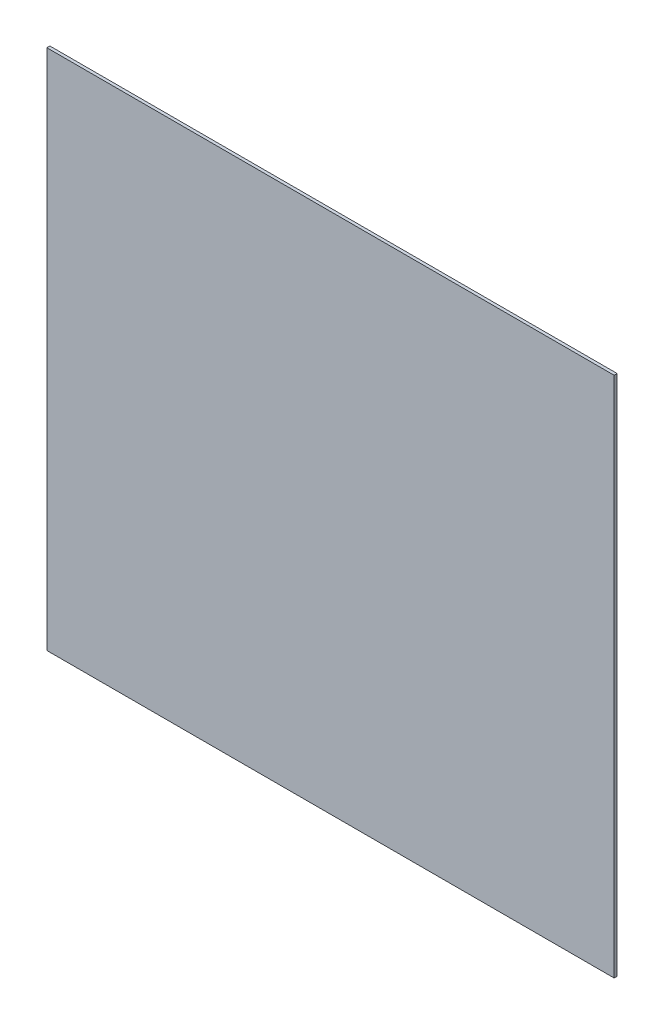
ISO-10303-21;
HEADER;
FILE_DESCRIPTION(('STEP AP214'),'2;1');
FILE_NAME('part.step','',(''),(''),'','','');
FILE_SCHEMA(('AUTOMOTIVE_DESIGN { 1 0 10303 214 1 1 1 1 }'));
ENDSEC;
DATA;
#1=APPLICATION_CONTEXT('core data for automotive mechanical design processes');
#2=APPLICATION_PROTOCOL_DEFINITION('international standard','automotive_design',2000,#1);
#3=PRODUCT_CONTEXT('',#1,'mechanical');
#4=PRODUCT('Part','Part','',(#3));
#5=PRODUCT_RELATED_PRODUCT_CATEGORY('part','',(#4));
#6=PRODUCT_DEFINITION_FORMATION('','',#4);
#7=PRODUCT_DEFINITION_CONTEXT('part definition',#1,'design');
#8=PRODUCT_DEFINITION('design','',#6,#7);
#9=PRODUCT_DEFINITION_SHAPE('','',#8);
#10=(LENGTH_UNIT() NAMED_UNIT(*) SI_UNIT(.MILLI.,.METRE.));
#11=(NAMED_UNIT(*) PLANE_ANGLE_UNIT() SI_UNIT($,.RADIAN.));
#12=(NAMED_UNIT(*) SI_UNIT($,.STERADIAN.) SOLID_ANGLE_UNIT());
#13=UNCERTAINTY_MEASURE_WITH_UNIT(LENGTH_MEASURE(1.E-05),#10,'distance_accuracy_value','');
#14=(GEOMETRIC_REPRESENTATION_CONTEXT(3) GLOBAL_UNCERTAINTY_ASSIGNED_CONTEXT((#13)) GLOBAL_UNIT_ASSIGNED_CONTEXT((#10,
#11,#12)) REPRESENTATION_CONTEXT('',''));
#15=CARTESIAN_POINT('',(0.,0.,0.));
#16=DIRECTION('',(0.,0.,1.));
#17=DIRECTION('',(1.,0.,0.));
#18=AXIS2_PLACEMENT_3D('',#15,#16,#17);
#19=CARTESIAN_POINT('',(282.5,260.,3.));
#20=DIRECTION('',(-1.,0.,0.));
#21=DIRECTION('',(0.,-1.,0.));
#22=AXIS2_PLACEMENT_3D('',#19,#20,#21);
#23=PLANE('',#22);
#24=DIRECTION('',(0.,1.,0.));
#25=VECTOR('',#24,1.);
#26=CARTESIAN_POINT('',(282.5,260.,0.));
#27=LINE('',#26,#25);
#28=CARTESIAN_POINT('',(282.5,-260.,0.));
#29=VERTEX_POINT('',#28);
#30=CARTESIAN_POINT('',(282.5,260.,0.));
#31=VERTEX_POINT('',#30);
#32=EDGE_CURVE('E96',#29,#31,#27,.T.);
#33=ORIENTED_EDGE('',*,*,#32,.T.);
#34=DIRECTION('',(0.,0.,-1.));
#35=VECTOR('',#34,1.);
#36=CARTESIAN_POINT('',(282.5,260.,3.));
#37=LINE('',#36,#35);
#38=CARTESIAN_POINT('',(282.5,260.,3.));
#39=VERTEX_POINT('',#38);
#40=EDGE_CURVE('E11',#39,#31,#37,.T.);
#41=ORIENTED_EDGE('',*,*,#40,.F.);
#42=DIRECTION('',(0.,1.,0.));
#43=VECTOR('',#42,1.);
#44=CARTESIAN_POINT('',(282.5,260.,3.));
#45=LINE('',#44,#43);
#46=CARTESIAN_POINT('',(282.5,-260.,3.));
#47=VERTEX_POINT('',#46);
#48=EDGE_CURVE('E84',#47,#39,#45,.T.);
#49=ORIENTED_EDGE('',*,*,#48,.F.);
#50=DIRECTION('',(0.,0.,-1.));
#51=VECTOR('',#50,1.);
#52=CARTESIAN_POINT('',(282.5,-260.,3.));
#53=LINE('',#52,#51);
#54=EDGE_CURVE('E92',#47,#29,#53,.T.);
#55=ORIENTED_EDGE('',*,*,#54,.T.);
#56=EDGE_LOOP('',(#33,#41,#49,#55));
#57=FACE_BOUND('',#56,.T.);
#58=ADVANCED_FACE('F33',(#57),#23,.F.);
#59=CARTESIAN_POINT('',(-282.5,260.,3.));
#60=DIRECTION('',(0.,-1.,0.));
#61=DIRECTION('',(0.,0.,-1.));
#62=AXIS2_PLACEMENT_3D('',#59,#60,#61);
#63=PLANE('',#62);
#64=DIRECTION('',(-1.,0.,0.));
#65=VECTOR('',#64,1.);
#66=CARTESIAN_POINT('',(-282.5,260.,0.));
#67=LINE('',#66,#65);
#68=CARTESIAN_POINT('',(-282.5,260.,0.));
#69=VERTEX_POINT('',#68);
#70=EDGE_CURVE('E88',#31,#69,#67,.T.);
#71=ORIENTED_EDGE('',*,*,#70,.T.);
#72=DIRECTION('',(0.,0.,-1.));
#73=VECTOR('',#72,1.);
#74=CARTESIAN_POINT('',(-282.5,260.,3.));
#75=LINE('',#74,#73);
#76=CARTESIAN_POINT('',(-282.5,260.,3.));
#77=VERTEX_POINT('',#76);
#78=EDGE_CURVE('E41',#77,#69,#75,.T.);
#79=ORIENTED_EDGE('',*,*,#78,.F.);
#80=DIRECTION('',(-1.,0.,0.));
#81=VECTOR('',#80,1.);
#82=CARTESIAN_POINT('',(-282.5,260.,3.));
#83=LINE('',#82,#81);
#84=EDGE_CURVE('E79',#39,#77,#83,.T.);
#85=ORIENTED_EDGE('',*,*,#84,.F.);
#86=ORIENTED_EDGE('',*,*,#40,.T.);
#87=EDGE_LOOP('',(#71,#79,#85,#86));
#88=FACE_BOUND('',#87,.T.);
#89=ADVANCED_FACE('F87',(#88),#63,.F.);
#90=CARTESIAN_POINT('',(-282.5,260.,3.));
#91=DIRECTION('',(1.,0.,0.));
#92=DIRECTION('',(0.,1.,0.));
#93=AXIS2_PLACEMENT_3D('',#90,#91,#92);
#94=PLANE('',#93);
#95=DIRECTION('',(0.,-1.,0.));
#96=VECTOR('',#95,1.);
#97=CARTESIAN_POINT('',(-282.5,260.,0.));
#98=LINE('',#97,#96);
#99=CARTESIAN_POINT('',(-282.5,-260.,0.));
#100=VERTEX_POINT('',#99);
#101=EDGE_CURVE('E66',#69,#100,#98,.T.);
#102=ORIENTED_EDGE('',*,*,#101,.T.);
#103=DIRECTION('',(0.,0.,-1.));
#104=VECTOR('',#103,1.);
#105=CARTESIAN_POINT('',(-282.5,-260.,3.));
#106=LINE('',#105,#104);
#107=CARTESIAN_POINT('',(-282.5,-260.,3.));
#108=VERTEX_POINT('',#107);
#109=EDGE_CURVE('E89',#108,#100,#106,.T.);
#110=ORIENTED_EDGE('',*,*,#109,.F.);
#111=DIRECTION('',(0.,-1.,0.));
#112=VECTOR('',#111,1.);
#113=CARTESIAN_POINT('',(-282.5,260.,3.));
#114=LINE('',#113,#112);
#115=EDGE_CURVE('E82',#77,#108,#114,.T.);
#116=ORIENTED_EDGE('',*,*,#115,.F.);
#117=ORIENTED_EDGE('',*,*,#78,.T.);
#118=EDGE_LOOP('',(#102,#110,#116,#117));
#119=FACE_BOUND('',#118,.T.);
#120=ADVANCED_FACE('F90',(#119),#94,.F.);
#121=CARTESIAN_POINT('',(-282.5,-260.,3.));
#122=DIRECTION('',(0.,1.,0.));
#123=DIRECTION('',(0.,0.,1.));
#124=AXIS2_PLACEMENT_3D('',#121,#122,#123);
#125=PLANE('',#124);
#126=DIRECTION('',(1.,0.,0.));
#127=VECTOR('',#126,1.);
#128=CARTESIAN_POINT('',(-282.5,-260.,0.));
#129=LINE('',#128,#127);
#130=EDGE_CURVE('E72',#100,#29,#129,.T.);
#131=ORIENTED_EDGE('',*,*,#130,.T.);
#132=ORIENTED_EDGE('',*,*,#54,.F.);
#133=DIRECTION('',(1.,0.,0.));
#134=VECTOR('',#133,1.);
#135=CARTESIAN_POINT('',(-282.5,-260.,3.));
#136=LINE('',#135,#134);
#137=EDGE_CURVE('E49',#108,#47,#136,.T.);
#138=ORIENTED_EDGE('',*,*,#137,.F.);
#139=ORIENTED_EDGE('',*,*,#109,.T.);
#140=EDGE_LOOP('',(#131,#132,#138,#139));
#141=FACE_BOUND('',#140,.T.);
#142=ADVANCED_FACE('F103',(#141),#125,.F.);
#143=CARTESIAN_POINT('',(0.,0.,3.));
#144=DIRECTION('',(0.,0.,1.));
#145=DIRECTION('',(1.,0.,0.));
#146=AXIS2_PLACEMENT_3D('',#143,#144,#145);
#147=PLANE('',#146);
#148=ORIENTED_EDGE('',*,*,#48,.T.);
#149=ORIENTED_EDGE('',*,*,#84,.T.);
#150=ORIENTED_EDGE('',*,*,#115,.T.);
#151=ORIENTED_EDGE('',*,*,#137,.T.);
#152=EDGE_LOOP('',(#148,#149,#150,#151));
#153=FACE_BOUND('',#152,.T.);
#154=ADVANCED_FACE('F80',(#153),#147,.T.);
#155=CARTESIAN_POINT('',(0.,0.,0.));
#156=DIRECTION('',(0.,0.,1.));
#157=DIRECTION('',(1.,0.,0.));
#158=AXIS2_PLACEMENT_3D('',#155,#156,#157);
#159=PLANE('',#158);
#160=ORIENTED_EDGE('',*,*,#32,.F.);
#161=ORIENTED_EDGE('',*,*,#130,.F.);
#162=ORIENTED_EDGE('',*,*,#101,.F.);
#163=ORIENTED_EDGE('',*,*,#70,.F.);
#164=EDGE_LOOP('',(#160,#161,#162,#163));
#165=FACE_BOUND('',#164,.T.);
#166=ADVANCED_FACE('F106',(#165),#159,.F.);
#167=CLOSED_SHELL('',(#58,#89,#120,#142,#154,#166));
#168=MANIFOLD_SOLID_BREP('B2',#167);
#169=ADVANCED_BREP_SHAPE_REPRESENTATION('',(#18,#168),#14);
#170=SHAPE_DEFINITION_REPRESENTATION(#9,#169);
ENDSEC;
END-ISO-10303-21;
